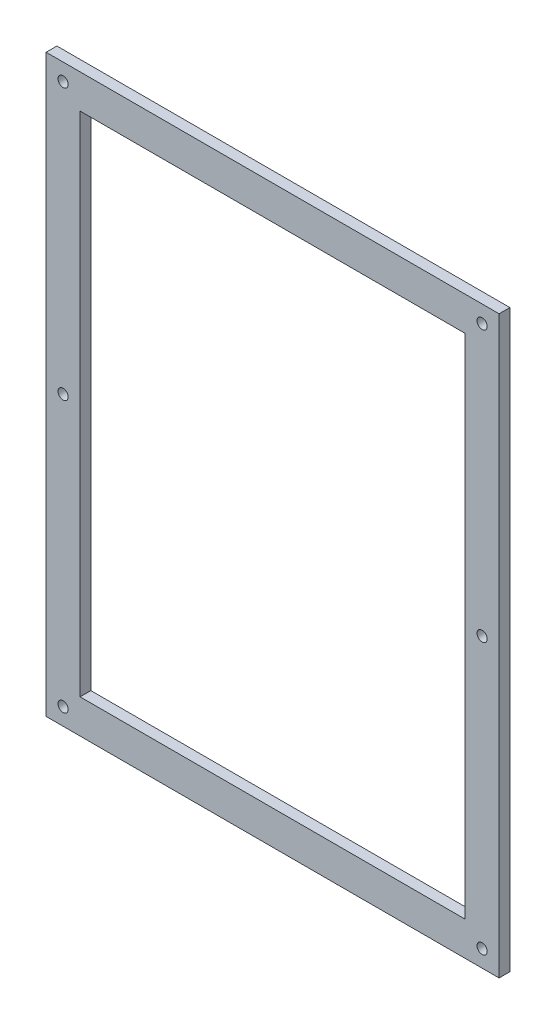
ISO-10303-21;
HEADER;
FILE_DESCRIPTION(('STEP AP214'),'2;1');
FILE_NAME('part.step','',(''),(''),'','','');
FILE_SCHEMA(('AUTOMOTIVE_DESIGN { 1 0 10303 214 1 1 1 1 }'));
ENDSEC;
DATA;
#1=APPLICATION_CONTEXT('core data for automotive mechanical design processes');
#2=APPLICATION_PROTOCOL_DEFINITION('international standard','automotive_design',2000,#1);
#3=PRODUCT_CONTEXT('',#1,'mechanical');
#4=PRODUCT('Part','Part','',(#3));
#5=PRODUCT_RELATED_PRODUCT_CATEGORY('part','',(#4));
#6=PRODUCT_DEFINITION_FORMATION('','',#4);
#7=PRODUCT_DEFINITION_CONTEXT('part definition',#1,'design');
#8=PRODUCT_DEFINITION('design','',#6,#7);
#9=PRODUCT_DEFINITION_SHAPE('','',#8);
#10=(LENGTH_UNIT() NAMED_UNIT(*) SI_UNIT(.MILLI.,.METRE.));
#11=(NAMED_UNIT(*) PLANE_ANGLE_UNIT() SI_UNIT($,.RADIAN.));
#12=(NAMED_UNIT(*) SI_UNIT($,.STERADIAN.) SOLID_ANGLE_UNIT());
#13=UNCERTAINTY_MEASURE_WITH_UNIT(LENGTH_MEASURE(1.E-05),#10,'distance_accuracy_value','');
#14=(GEOMETRIC_REPRESENTATION_CONTEXT(3) GLOBAL_UNCERTAINTY_ASSIGNED_CONTEXT((#13)) GLOBAL_UNIT_ASSIGNED_CONTEXT((#10,
#11,#12)) REPRESENTATION_CONTEXT('',''));
#15=CARTESIAN_POINT('',(0.,0.,0.));
#16=DIRECTION('',(0.,0.,1.));
#17=DIRECTION('',(1.,0.,0.));
#18=AXIS2_PLACEMENT_3D('',#15,#16,#17);
#19=CARTESIAN_POINT('',(0.,0.,3.175));
#20=DIRECTION('',(0.,0.,-1.));
#21=DIRECTION('',(-1.,0.,0.));
#22=AXIS2_PLACEMENT_3D('',#19,#20,#21);
#23=PLANE('',#22);
#24=DIRECTION('',(-1.,0.,0.));
#25=VECTOR('',#24,1.);
#26=CARTESIAN_POINT('',(10.,159.333333333333,3.175));
#27=LINE('',#26,#25);
#28=CARTESIAN_POINT('',(123.35,159.333333333333,3.175));
#29=VERTEX_POINT('',#28);
#30=CARTESIAN_POINT('',(10.,159.333333333333,3.175));
#31=VERTEX_POINT('',#30);
#32=EDGE_CURVE('E133',#29,#31,#27,.T.);
#33=ORIENTED_EDGE('',*,*,#32,.F.);
#34=DIRECTION('',(0.,1.,0.));
#35=VECTOR('',#34,1.);
#36=CARTESIAN_POINT('',(123.35,159.333333333333,3.175));
#37=LINE('',#36,#35);
#38=CARTESIAN_POINT('',(123.35,10.,3.175));
#39=VERTEX_POINT('',#38);
#40=EDGE_CURVE('E123',#39,#29,#37,.T.);
#41=ORIENTED_EDGE('',*,*,#40,.F.);
#42=DIRECTION('',(1.,0.,0.));
#43=VECTOR('',#42,1.);
#44=CARTESIAN_POINT('',(123.35,10.,3.175));
#45=LINE('',#44,#43);
#46=CARTESIAN_POINT('',(9.99999999999999,9.99999999999999,3.175));
#47=VERTEX_POINT('',#46);
#48=EDGE_CURVE('E137',#47,#39,#45,.T.);
#49=ORIENTED_EDGE('',*,*,#48,.F.);
#50=DIRECTION('',(0.,-1.,0.));
#51=VECTOR('',#50,1.);
#52=CARTESIAN_POINT('',(9.99999999999999,9.99999999999999,3.175));
#53=LINE('',#52,#51);
#54=EDGE_CURVE('E55',#31,#47,#53,.T.);
#55=ORIENTED_EDGE('',*,*,#54,.F.);
#56=EDGE_LOOP('',(#33,#41,#49,#55));
#57=FACE_BOUND('',#56,.T.);
#58=DIRECTION('',(1.,0.,0.));
#59=VECTOR('',#58,1.);
#60=CARTESIAN_POINT('',(133.35,0.,3.175));
#61=LINE('',#60,#59);
#62=CARTESIAN_POINT('',(0.,0.,3.175));
#63=VERTEX_POINT('',#62);
#64=CARTESIAN_POINT('',(133.35,0.,3.175));
#65=VERTEX_POINT('',#64);
#66=EDGE_CURVE('E200',#63,#65,#61,.T.);
#67=ORIENTED_EDGE('',*,*,#66,.T.);
#68=DIRECTION('',(0.,1.,0.));
#69=VECTOR('',#68,1.);
#70=CARTESIAN_POINT('',(133.35,169.333333333333,3.175));
#71=LINE('',#70,#69);
#72=CARTESIAN_POINT('',(133.35,169.333333333333,3.175));
#73=VERTEX_POINT('',#72);
#74=EDGE_CURVE('E204',#65,#73,#71,.T.);
#75=ORIENTED_EDGE('',*,*,#74,.T.);
#76=DIRECTION('',(-1.,0.,0.));
#77=VECTOR('',#76,1.);
#78=CARTESIAN_POINT('',(0.,169.333333333333,3.175));
#79=LINE('',#78,#77);
#80=CARTESIAN_POINT('',(0.,169.333333333333,3.175));
#81=VERTEX_POINT('',#80);
#82=EDGE_CURVE('E208',#73,#81,#79,.T.);
#83=ORIENTED_EDGE('',*,*,#82,.T.);
#84=DIRECTION('',(0.,-1.,0.));
#85=VECTOR('',#84,1.);
#86=CARTESIAN_POINT('',(0.,0.,3.175));
#87=LINE('',#86,#85);
#88=EDGE_CURVE('E211',#81,#63,#87,.T.);
#89=ORIENTED_EDGE('',*,*,#88,.T.);
#90=EDGE_LOOP('',(#67,#75,#83,#89));
#91=FACE_BOUND('',#90,.T.);
#92=CARTESIAN_POINT('',(5.,4.99999999999999,3.175));
#93=DIRECTION('',(0.,0.,1.));
#94=DIRECTION('',(1.,0.,0.));
#95=AXIS2_PLACEMENT_3D('',#92,#93,#94);
#96=CIRCLE('',#95,1.5);
#97=CARTESIAN_POINT('',(6.5,4.99999999999999,3.175));
#98=VERTEX_POINT('',#97);
#99=EDGE_CURVE('E192',#98,#98,#96,.T.);
#100=ORIENTED_EDGE('',*,*,#99,.F.);
#101=EDGE_LOOP('',(#100));
#102=FACE_BOUND('',#101,.T.);
#103=CARTESIAN_POINT('',(5.,164.333333333333,3.175));
#104=DIRECTION('',(0.,0.,1.));
#105=DIRECTION('',(-1.,0.,0.));
#106=AXIS2_PLACEMENT_3D('',#103,#104,#105);
#107=CIRCLE('',#106,1.5);
#108=CARTESIAN_POINT('',(3.5,164.333333333333,3.175));
#109=VERTEX_POINT('',#108);
#110=EDGE_CURVE('E184',#109,#109,#107,.T.);
#111=ORIENTED_EDGE('',*,*,#110,.F.);
#112=EDGE_LOOP('',(#111));
#113=FACE_BOUND('',#112,.T.);
#114=CARTESIAN_POINT('',(5.,84.6666666666667,3.175));
#115=DIRECTION('',(0.,0.,1.));
#116=DIRECTION('',(1.,0.,0.));
#117=AXIS2_PLACEMENT_3D('',#114,#115,#116);
#118=CIRCLE('',#117,1.5);
#119=CARTESIAN_POINT('',(6.50000000000001,84.6666666666667,3.175));
#120=VERTEX_POINT('',#119);
#121=EDGE_CURVE('E176',#120,#120,#118,.T.);
#122=ORIENTED_EDGE('',*,*,#121,.F.);
#123=EDGE_LOOP('',(#122));
#124=FACE_BOUND('',#123,.T.);
#125=CARTESIAN_POINT('',(128.35,164.333333333333,3.175));
#126=DIRECTION('',(0.,0.,1.));
#127=DIRECTION('',(1.,0.,0.));
#128=AXIS2_PLACEMENT_3D('',#125,#126,#127);
#129=CIRCLE('',#128,1.5);
#130=CARTESIAN_POINT('',(129.85,164.333333333333,3.175));
#131=VERTEX_POINT('',#130);
#132=EDGE_CURVE('E168',#131,#131,#129,.T.);
#133=ORIENTED_EDGE('',*,*,#132,.F.);
#134=EDGE_LOOP('',(#133));
#135=FACE_BOUND('',#134,.T.);
#136=CARTESIAN_POINT('',(128.35,84.6666666666667,3.175));
#137=DIRECTION('',(0.,0.,1.));
#138=DIRECTION('',(-1.,0.,0.));
#139=AXIS2_PLACEMENT_3D('',#136,#137,#138);
#140=CIRCLE('',#139,1.5);
#141=CARTESIAN_POINT('',(126.85,84.6666666666667,3.175));
#142=VERTEX_POINT('',#141);
#143=EDGE_CURVE('E160',#142,#142,#140,.T.);
#144=ORIENTED_EDGE('',*,*,#143,.F.);
#145=EDGE_LOOP('',(#144));
#146=FACE_BOUND('',#145,.T.);
#147=CARTESIAN_POINT('',(128.35,4.99999999999999,3.175));
#148=DIRECTION('',(0.,0.,1.));
#149=DIRECTION('',(-1.,0.,0.));
#150=AXIS2_PLACEMENT_3D('',#147,#148,#149);
#151=CIRCLE('',#150,1.5);
#152=CARTESIAN_POINT('',(126.85,4.99999999999999,3.175));
#153=VERTEX_POINT('',#152);
#154=EDGE_CURVE('E152',#153,#153,#151,.T.);
#155=ORIENTED_EDGE('',*,*,#154,.F.);
#156=EDGE_LOOP('',(#155));
#157=FACE_BOUND('',#156,.T.);
#158=ADVANCED_FACE('F39',(#57,#91,#102,#113,#124,#135,#146,#157),#23,.F.);
#159=CARTESIAN_POINT('',(0.,0.,0.));
#160=DIRECTION('',(0.,0.,-1.));
#161=DIRECTION('',(-1.,0.,0.));
#162=AXIS2_PLACEMENT_3D('',#159,#160,#161);
#163=PLANE('',#162);
#164=DIRECTION('',(0.,1.,0.));
#165=VECTOR('',#164,1.);
#166=CARTESIAN_POINT('',(123.35,159.333333333333,0.));
#167=LINE('',#166,#165);
#168=CARTESIAN_POINT('',(123.35,10.,0.));
#169=VERTEX_POINT('',#168);
#170=CARTESIAN_POINT('',(123.35,159.333333333333,0.));
#171=VERTEX_POINT('',#170);
#172=EDGE_CURVE('E120',#169,#171,#167,.T.);
#173=ORIENTED_EDGE('',*,*,#172,.T.);
#174=DIRECTION('',(-1.,0.,0.));
#175=VECTOR('',#174,1.);
#176=CARTESIAN_POINT('',(10.,159.333333333333,0.));
#177=LINE('',#176,#175);
#178=CARTESIAN_POINT('',(10.,159.333333333333,0.));
#179=VERTEX_POINT('',#178);
#180=EDGE_CURVE('E106',#171,#179,#177,.T.);
#181=ORIENTED_EDGE('',*,*,#180,.T.);
#182=DIRECTION('',(0.,-1.,0.));
#183=VECTOR('',#182,1.);
#184=CARTESIAN_POINT('',(9.99999999999999,9.99999999999999,0.));
#185=LINE('',#184,#183);
#186=CARTESIAN_POINT('',(9.99999999999999,9.99999999999999,0.));
#187=VERTEX_POINT('',#186);
#188=EDGE_CURVE('E142',#179,#187,#185,.T.);
#189=ORIENTED_EDGE('',*,*,#188,.T.);
#190=DIRECTION('',(1.,0.,0.));
#191=VECTOR('',#190,1.);
#192=CARTESIAN_POINT('',(123.35,10.,0.));
#193=LINE('',#192,#191);
#194=EDGE_CURVE('E129',#187,#169,#193,.T.);
#195=ORIENTED_EDGE('',*,*,#194,.T.);
#196=EDGE_LOOP('',(#173,#181,#189,#195));
#197=FACE_BOUND('',#196,.T.);
#198=CARTESIAN_POINT('',(128.35,84.6666666666667,0.));
#199=DIRECTION('',(0.,0.,1.));
#200=DIRECTION('',(-1.,0.,0.));
#201=AXIS2_PLACEMENT_3D('',#198,#199,#200);
#202=CIRCLE('',#201,1.5);
#203=CARTESIAN_POINT('',(126.85,84.6666666666667,0.));
#204=VERTEX_POINT('',#203);
#205=EDGE_CURVE('E156',#204,#204,#202,.T.);
#206=ORIENTED_EDGE('',*,*,#205,.T.);
#207=EDGE_LOOP('',(#206));
#208=FACE_BOUND('',#207,.T.);
#209=CARTESIAN_POINT('',(5.,84.6666666666667,0.));
#210=DIRECTION('',(0.,0.,1.));
#211=DIRECTION('',(1.,0.,0.));
#212=AXIS2_PLACEMENT_3D('',#209,#210,#211);
#213=CIRCLE('',#212,1.5);
#214=CARTESIAN_POINT('',(6.50000000000001,84.6666666666667,0.));
#215=VERTEX_POINT('',#214);
#216=EDGE_CURVE('E172',#215,#215,#213,.T.);
#217=ORIENTED_EDGE('',*,*,#216,.T.);
#218=EDGE_LOOP('',(#217));
#219=FACE_BOUND('',#218,.T.);
#220=CARTESIAN_POINT('',(5.,4.99999999999999,0.));
#221=DIRECTION('',(0.,0.,1.));
#222=DIRECTION('',(1.,0.,0.));
#223=AXIS2_PLACEMENT_3D('',#220,#221,#222);
#224=CIRCLE('',#223,1.5);
#225=CARTESIAN_POINT('',(6.5,4.99999999999999,0.));
#226=VERTEX_POINT('',#225);
#227=EDGE_CURVE('E188',#226,#226,#224,.T.);
#228=ORIENTED_EDGE('',*,*,#227,.T.);
#229=EDGE_LOOP('',(#228));
#230=FACE_BOUND('',#229,.T.);
#231=DIRECTION('',(1.,0.,0.));
#232=VECTOR('',#231,1.);
#233=CARTESIAN_POINT('',(133.35,0.,0.));
#234=LINE('',#233,#232);
#235=CARTESIAN_POINT('',(0.,0.,0.));
#236=VERTEX_POINT('',#235);
#237=CARTESIAN_POINT('',(133.35,0.,0.));
#238=VERTEX_POINT('',#237);
#239=EDGE_CURVE('E196',#236,#238,#234,.T.);
#240=ORIENTED_EDGE('',*,*,#239,.F.);
#241=DIRECTION('',(0.,-1.,0.));
#242=VECTOR('',#241,1.);
#243=CARTESIAN_POINT('',(0.,0.,0.));
#244=LINE('',#243,#242);
#245=CARTESIAN_POINT('',(0.,169.333333333333,0.));
#246=VERTEX_POINT('',#245);
#247=EDGE_CURVE('E205',#246,#236,#244,.T.);
#248=ORIENTED_EDGE('',*,*,#247,.F.);
#249=DIRECTION('',(-1.,0.,0.));
#250=VECTOR('',#249,1.);
#251=CARTESIAN_POINT('',(0.,169.333333333333,0.));
#252=LINE('',#251,#250);
#253=CARTESIAN_POINT('',(133.35,169.333333333333,0.));
#254=VERTEX_POINT('',#253);
#255=EDGE_CURVE('E221',#254,#246,#252,.T.);
#256=ORIENTED_EDGE('',*,*,#255,.F.);
#257=DIRECTION('',(0.,1.,0.));
#258=VECTOR('',#257,1.);
#259=CARTESIAN_POINT('',(133.35,169.333333333333,0.));
#260=LINE('',#259,#258);
#261=EDGE_CURVE('E218',#238,#254,#260,.T.);
#262=ORIENTED_EDGE('',*,*,#261,.F.);
#263=EDGE_LOOP('',(#240,#248,#256,#262));
#264=FACE_BOUND('',#263,.T.);
#265=CARTESIAN_POINT('',(5.,164.333333333333,0.));
#266=DIRECTION('',(0.,0.,1.));
#267=DIRECTION('',(-1.,0.,0.));
#268=AXIS2_PLACEMENT_3D('',#265,#266,#267);
#269=CIRCLE('',#268,1.5);
#270=CARTESIAN_POINT('',(3.5,164.333333333333,0.));
#271=VERTEX_POINT('',#270);
#272=EDGE_CURVE('E180',#271,#271,#269,.T.);
#273=ORIENTED_EDGE('',*,*,#272,.T.);
#274=EDGE_LOOP('',(#273));
#275=FACE_BOUND('',#274,.T.);
#276=CARTESIAN_POINT('',(128.35,164.333333333333,0.));
#277=DIRECTION('',(0.,0.,1.));
#278=DIRECTION('',(1.,0.,0.));
#279=AXIS2_PLACEMENT_3D('',#276,#277,#278);
#280=CIRCLE('',#279,1.5);
#281=CARTESIAN_POINT('',(129.85,164.333333333333,0.));
#282=VERTEX_POINT('',#281);
#283=EDGE_CURVE('E164',#282,#282,#280,.T.);
#284=ORIENTED_EDGE('',*,*,#283,.T.);
#285=EDGE_LOOP('',(#284));
#286=FACE_BOUND('',#285,.T.);
#287=CARTESIAN_POINT('',(128.35,4.99999999999999,0.));
#288=DIRECTION('',(0.,0.,1.));
#289=DIRECTION('',(-1.,0.,0.));
#290=AXIS2_PLACEMENT_3D('',#287,#288,#289);
#291=CIRCLE('',#290,1.5);
#292=CARTESIAN_POINT('',(126.85,4.99999999999999,0.));
#293=VERTEX_POINT('',#292);
#294=EDGE_CURVE('E151',#293,#293,#291,.T.);
#295=ORIENTED_EDGE('',*,*,#294,.T.);
#296=EDGE_LOOP('',(#295));
#297=FACE_BOUND('',#296,.T.);
#298=ADVANCED_FACE('F127',(#197,#208,#219,#230,#264,#275,#286,#297),#163,.T.);
#299=CARTESIAN_POINT('',(133.35,0.,3.175));
#300=DIRECTION('',(0.,1.,0.));
#301=DIRECTION('',(0.,0.,1.));
#302=AXIS2_PLACEMENT_3D('',#299,#300,#301);
#303=PLANE('',#302);
#304=ORIENTED_EDGE('',*,*,#239,.T.);
#305=DIRECTION('',(0.,0.,-1.));
#306=VECTOR('',#305,1.);
#307=CARTESIAN_POINT('',(133.35,0.,3.175));
#308=LINE('',#307,#306);
#309=EDGE_CURVE('E11',#65,#238,#308,.T.);
#310=ORIENTED_EDGE('',*,*,#309,.F.);
#311=ORIENTED_EDGE('',*,*,#66,.F.);
#312=DIRECTION('',(0.,0.,-1.));
#313=VECTOR('',#312,1.);
#314=CARTESIAN_POINT('',(0.,0.,3.175));
#315=LINE('',#314,#313);
#316=EDGE_CURVE('E214',#63,#236,#315,.T.);
#317=ORIENTED_EDGE('',*,*,#316,.T.);
#318=EDGE_LOOP('',(#304,#310,#311,#317));
#319=FACE_BOUND('',#318,.T.);
#320=ADVANCED_FACE('F41',(#319),#303,.F.);
#321=CARTESIAN_POINT('',(133.35,169.333333333333,3.175));
#322=DIRECTION('',(-1.,0.,0.));
#323=DIRECTION('',(0.,0.,1.));
#324=AXIS2_PLACEMENT_3D('',#321,#322,#323);
#325=PLANE('',#324);
#326=ORIENTED_EDGE('',*,*,#261,.T.);
#327=DIRECTION('',(0.,0.,-1.));
#328=VECTOR('',#327,1.);
#329=CARTESIAN_POINT('',(133.35,169.333333333333,3.175));
#330=LINE('',#329,#328);
#331=EDGE_CURVE('E48',#73,#254,#330,.T.);
#332=ORIENTED_EDGE('',*,*,#331,.F.);
#333=ORIENTED_EDGE('',*,*,#74,.F.);
#334=ORIENTED_EDGE('',*,*,#309,.T.);
#335=EDGE_LOOP('',(#326,#332,#333,#334));
#336=FACE_BOUND('',#335,.T.);
#337=ADVANCED_FACE('F254',(#336),#325,.F.);
#338=CARTESIAN_POINT('',(0.,169.333333333333,3.175));
#339=DIRECTION('',(0.,-1.,0.));
#340=DIRECTION('',(0.,0.,-1.));
#341=AXIS2_PLACEMENT_3D('',#338,#339,#340);
#342=PLANE('',#341);
#343=ORIENTED_EDGE('',*,*,#255,.T.);
#344=DIRECTION('',(0.,0.,-1.));
#345=VECTOR('',#344,1.);
#346=CARTESIAN_POINT('',(0.,169.333333333333,3.175));
#347=LINE('',#346,#345);
#348=EDGE_CURVE('E229',#81,#246,#347,.T.);
#349=ORIENTED_EDGE('',*,*,#348,.F.);
#350=ORIENTED_EDGE('',*,*,#82,.F.);
#351=ORIENTED_EDGE('',*,*,#331,.T.);
#352=EDGE_LOOP('',(#343,#349,#350,#351));
#353=FACE_BOUND('',#352,.T.);
#354=ADVANCED_FACE('F238',(#353),#342,.F.);
#355=CARTESIAN_POINT('',(0.,0.,3.175));
#356=DIRECTION('',(1.,0.,0.));
#357=DIRECTION('',(0.,0.,-1.));
#358=AXIS2_PLACEMENT_3D('',#355,#356,#357);
#359=PLANE('',#358);
#360=ORIENTED_EDGE('',*,*,#247,.T.);
#361=ORIENTED_EDGE('',*,*,#316,.F.);
#362=ORIENTED_EDGE('',*,*,#88,.F.);
#363=ORIENTED_EDGE('',*,*,#348,.T.);
#364=EDGE_LOOP('',(#360,#361,#362,#363));
#365=FACE_BOUND('',#364,.T.);
#366=ADVANCED_FACE('F247',(#365),#359,.F.);
#367=CARTESIAN_POINT('',(5.,4.99999999999999,3.175));
#368=DIRECTION('',(0.,0.,-1.));
#369=DIRECTION('',(-1.,0.,0.));
#370=AXIS2_PLACEMENT_3D('',#367,#368,#369);
#371=CYLINDRICAL_SURFACE('',#370,1.5);
#372=ORIENTED_EDGE('',*,*,#99,.T.);
#373=EDGE_LOOP('',(#372));
#374=FACE_BOUND('',#373,.T.);
#375=ORIENTED_EDGE('',*,*,#227,.F.);
#376=EDGE_LOOP('',(#375));
#377=FACE_BOUND('',#376,.T.);
#378=ADVANCED_FACE('F269',(#374,#377),#371,.F.);
#379=CARTESIAN_POINT('',(5.,164.333333333333,3.175));
#380=DIRECTION('',(0.,0.,-1.));
#381=DIRECTION('',(-1.,0.,0.));
#382=AXIS2_PLACEMENT_3D('',#379,#380,#381);
#383=CYLINDRICAL_SURFACE('',#382,1.5);
#384=ORIENTED_EDGE('',*,*,#110,.T.);
#385=EDGE_LOOP('',(#384));
#386=FACE_BOUND('',#385,.T.);
#387=ORIENTED_EDGE('',*,*,#272,.F.);
#388=EDGE_LOOP('',(#387));
#389=FACE_BOUND('',#388,.T.);
#390=ADVANCED_FACE('F276',(#386,#389),#383,.F.);
#391=CARTESIAN_POINT('',(5.,84.6666666666667,3.175));
#392=DIRECTION('',(0.,0.,-1.));
#393=DIRECTION('',(-1.,0.,0.));
#394=AXIS2_PLACEMENT_3D('',#391,#392,#393);
#395=CYLINDRICAL_SURFACE('',#394,1.5);
#396=ORIENTED_EDGE('',*,*,#121,.T.);
#397=EDGE_LOOP('',(#396));
#398=FACE_BOUND('',#397,.T.);
#399=ORIENTED_EDGE('',*,*,#216,.F.);
#400=EDGE_LOOP('',(#399));
#401=FACE_BOUND('',#400,.T.);
#402=ADVANCED_FACE('F281',(#398,#401),#395,.F.);
#403=CARTESIAN_POINT('',(128.35,164.333333333333,3.175));
#404=DIRECTION('',(0.,0.,-1.));
#405=DIRECTION('',(-1.,0.,0.));
#406=AXIS2_PLACEMENT_3D('',#403,#404,#405);
#407=CYLINDRICAL_SURFACE('',#406,1.5);
#408=ORIENTED_EDGE('',*,*,#132,.T.);
#409=EDGE_LOOP('',(#408));
#410=FACE_BOUND('',#409,.T.);
#411=ORIENTED_EDGE('',*,*,#283,.F.);
#412=EDGE_LOOP('',(#411));
#413=FACE_BOUND('',#412,.T.);
#414=ADVANCED_FACE('F310',(#410,#413),#407,.F.);
#415=CARTESIAN_POINT('',(128.35,84.6666666666667,3.175));
#416=DIRECTION('',(0.,0.,-1.));
#417=DIRECTION('',(-1.,0.,0.));
#418=AXIS2_PLACEMENT_3D('',#415,#416,#417);
#419=CYLINDRICAL_SURFACE('',#418,1.5);
#420=ORIENTED_EDGE('',*,*,#143,.T.);
#421=EDGE_LOOP('',(#420));
#422=FACE_BOUND('',#421,.T.);
#423=ORIENTED_EDGE('',*,*,#205,.F.);
#424=EDGE_LOOP('',(#423));
#425=FACE_BOUND('',#424,.T.);
#426=ADVANCED_FACE('F301',(#422,#425),#419,.F.);
#427=CARTESIAN_POINT('',(128.35,4.99999999999999,3.175));
#428=DIRECTION('',(0.,0.,-1.));
#429=DIRECTION('',(-1.,0.,0.));
#430=AXIS2_PLACEMENT_3D('',#427,#428,#429);
#431=CYLINDRICAL_SURFACE('',#430,1.5);
#432=ORIENTED_EDGE('',*,*,#154,.T.);
#433=EDGE_LOOP('',(#432));
#434=FACE_BOUND('',#433,.T.);
#435=ORIENTED_EDGE('',*,*,#294,.F.);
#436=EDGE_LOOP('',(#435));
#437=FACE_BOUND('',#436,.T.);
#438=ADVANCED_FACE('F298',(#434,#437),#431,.F.);
#439=CARTESIAN_POINT('',(123.35,159.333333333333,-187.479777427979));
#440=DIRECTION('',(1.,0.,0.));
#441=DIRECTION('',(0.,1.,0.));
#442=AXIS2_PLACEMENT_3D('',#439,#440,#441);
#443=PLANE('',#442);
#444=DIRECTION('',(0.,0.,1.));
#445=VECTOR('',#444,1.);
#446=CARTESIAN_POINT('',(123.35,10.,-187.479777427979));
#447=LINE('',#446,#445);
#448=EDGE_CURVE('E63',#169,#39,#447,.T.);
#449=ORIENTED_EDGE('',*,*,#448,.T.);
#450=ORIENTED_EDGE('',*,*,#40,.T.);
#451=DIRECTION('',(0.,0.,1.));
#452=VECTOR('',#451,1.);
#453=CARTESIAN_POINT('',(123.35,159.333333333333,-187.479777427979));
#454=LINE('',#453,#452);
#455=EDGE_CURVE('E110',#171,#29,#454,.T.);
#456=ORIENTED_EDGE('',*,*,#455,.F.);
#457=ORIENTED_EDGE('',*,*,#172,.F.);
#458=EDGE_LOOP('',(#449,#450,#456,#457));
#459=FACE_BOUND('',#458,.T.);
#460=ADVANCED_FACE('F119',(#459),#443,.F.);
#461=CARTESIAN_POINT('',(10.,159.333333333333,-187.479777427979));
#462=DIRECTION('',(0.,1.,0.));
#463=DIRECTION('',(0.,0.,1.));
#464=AXIS2_PLACEMENT_3D('',#461,#462,#463);
#465=PLANE('',#464);
#466=ORIENTED_EDGE('',*,*,#455,.T.);
#467=ORIENTED_EDGE('',*,*,#32,.T.);
#468=DIRECTION('',(0.,0.,1.));
#469=VECTOR('',#468,1.);
#470=CARTESIAN_POINT('',(10.,159.333333333333,-187.479777427979));
#471=LINE('',#470,#469);
#472=EDGE_CURVE('E112',#179,#31,#471,.T.);
#473=ORIENTED_EDGE('',*,*,#472,.F.);
#474=ORIENTED_EDGE('',*,*,#180,.F.);
#475=EDGE_LOOP('',(#466,#467,#473,#474));
#476=FACE_BOUND('',#475,.T.);
#477=ADVANCED_FACE('F108',(#476),#465,.F.);
#478=CARTESIAN_POINT('',(9.99999999999999,9.99999999999999,-187.479777427979));
#479=DIRECTION('',(-1.,0.,0.));
#480=DIRECTION('',(0.,-1.,0.));
#481=AXIS2_PLACEMENT_3D('',#478,#479,#480);
#482=PLANE('',#481);
#483=ORIENTED_EDGE('',*,*,#472,.T.);
#484=ORIENTED_EDGE('',*,*,#54,.T.);
#485=DIRECTION('',(0.,0.,1.));
#486=VECTOR('',#485,1.);
#487=CARTESIAN_POINT('',(9.99999999999999,9.99999999999999,-187.479777427979));
#488=LINE('',#487,#486);
#489=EDGE_CURVE('E141',#187,#47,#488,.T.);
#490=ORIENTED_EDGE('',*,*,#489,.F.);
#491=ORIENTED_EDGE('',*,*,#188,.F.);
#492=EDGE_LOOP('',(#483,#484,#490,#491));
#493=FACE_BOUND('',#492,.T.);
#494=ADVANCED_FACE('F365',(#493),#482,.F.);
#495=CARTESIAN_POINT('',(123.35,10.,-187.479777427979));
#496=DIRECTION('',(0.,-1.,0.));
#497=DIRECTION('',(1.,0.,0.));
#498=AXIS2_PLACEMENT_3D('',#495,#496,#497);
#499=PLANE('',#498);
#500=ORIENTED_EDGE('',*,*,#489,.T.);
#501=ORIENTED_EDGE('',*,*,#48,.T.);
#502=ORIENTED_EDGE('',*,*,#448,.F.);
#503=ORIENTED_EDGE('',*,*,#194,.F.);
#504=EDGE_LOOP('',(#500,#501,#502,#503));
#505=FACE_BOUND('',#504,.T.);
#506=ADVANCED_FACE('F373',(#505),#499,.F.);
#507=CLOSED_SHELL('',(#158,#298,#320,#337,#354,#366,#378,#390,#402,#414,#426,#438,#460,#477,
#494,#506));
#508=MANIFOLD_SOLID_BREP('B2',#507);
#509=ADVANCED_BREP_SHAPE_REPRESENTATION('',(#18,#508),#14);
#510=SHAPE_DEFINITION_REPRESENTATION(#9,#509);
ENDSEC;
END-ISO-10303-21;
